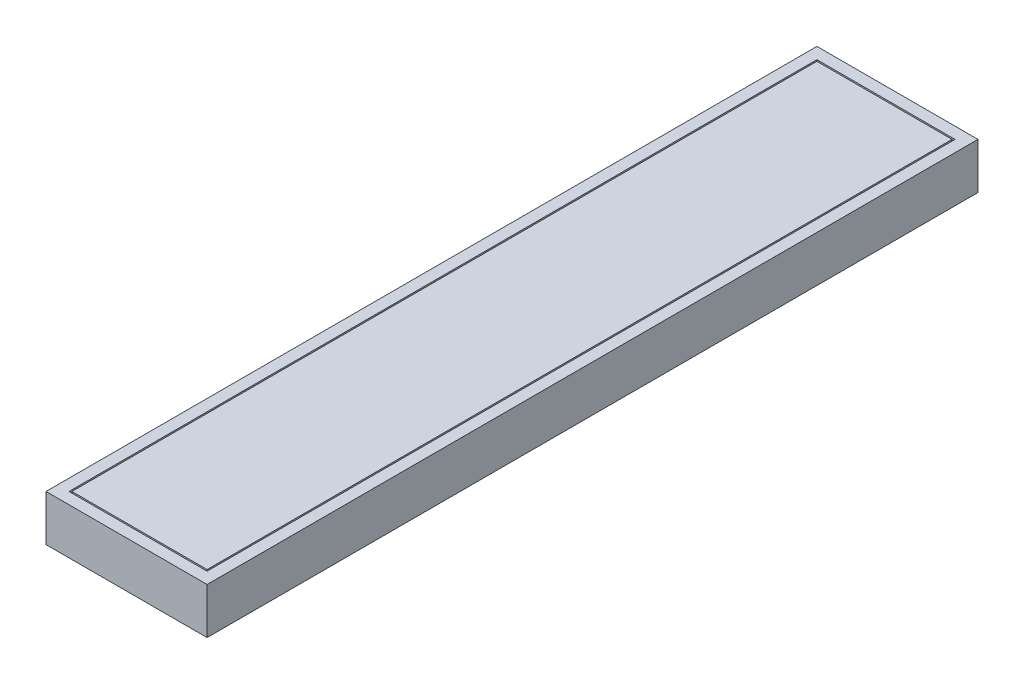
ISO-10303-21;
HEADER;
FILE_DESCRIPTION(('STEP AP214'),'2;1');
FILE_NAME('part.step','',(''),(''),'','','');
FILE_SCHEMA(('AUTOMOTIVE_DESIGN { 1 0 10303 214 1 1 1 1 }'));
ENDSEC;
DATA;
#1=APPLICATION_CONTEXT('core data for automotive mechanical design processes');
#2=APPLICATION_PROTOCOL_DEFINITION('international standard','automotive_design',2000,#1);
#3=PRODUCT_CONTEXT('',#1,'mechanical');
#4=PRODUCT('Part','Part','',(#3));
#5=PRODUCT_RELATED_PRODUCT_CATEGORY('part','',(#4));
#6=PRODUCT_DEFINITION_FORMATION('','',#4);
#7=PRODUCT_DEFINITION_CONTEXT('part definition',#1,'design');
#8=PRODUCT_DEFINITION('design','',#6,#7);
#9=PRODUCT_DEFINITION_SHAPE('','',#8);
#10=(LENGTH_UNIT() NAMED_UNIT(*) SI_UNIT(.MILLI.,.METRE.));
#11=(NAMED_UNIT(*) PLANE_ANGLE_UNIT() SI_UNIT($,.RADIAN.));
#12=(NAMED_UNIT(*) SI_UNIT($,.STERADIAN.) SOLID_ANGLE_UNIT());
#13=UNCERTAINTY_MEASURE_WITH_UNIT(LENGTH_MEASURE(1.E-05),#10,'distance_accuracy_value','');
#14=(GEOMETRIC_REPRESENTATION_CONTEXT(3) GLOBAL_UNCERTAINTY_ASSIGNED_CONTEXT((#13)) GLOBAL_UNIT_ASSIGNED_CONTEXT((#10,
#11,#12)) REPRESENTATION_CONTEXT('',''));
#15=CARTESIAN_POINT('',(0.,0.,0.));
#16=DIRECTION('',(0.,0.,1.));
#17=DIRECTION('',(1.,0.,0.));
#18=AXIS2_PLACEMENT_3D('',#15,#16,#17);
#19=CARTESIAN_POINT('',(0.,8.99999999999999,0.));
#20=DIRECTION('',(0.,1.,0.));
#21=DIRECTION('',(0.,0.,1.));
#22=AXIS2_PLACEMENT_3D('',#19,#20,#21);
#23=PLANE('',#22);
#24=DIRECTION('',(0.,0.,1.));
#25=VECTOR('',#24,1.);
#26=CARTESIAN_POINT('',(-120.,8.99999999999999,20.));
#27=LINE('',#26,#25);
#28=CARTESIAN_POINT('',(-120.,8.99999999999999,20.));
#29=VERTEX_POINT('',#28);
#30=CARTESIAN_POINT('',(-120.,8.99999999999999,1320.));
#31=VERTEX_POINT('',#30);
#32=EDGE_CURVE('E153',#29,#31,#27,.T.);
#33=ORIENTED_EDGE('',*,*,#32,.T.);
#34=DIRECTION('',(1.,0.,0.));
#35=VECTOR('',#34,1.);
#36=CARTESIAN_POINT('',(-120.,8.99999999999999,1320.));
#37=LINE('',#36,#35);
#38=CARTESIAN_POINT('',(120.,8.99999999999999,1320.));
#39=VERTEX_POINT('',#38);
#40=EDGE_CURVE('E156',#31,#39,#37,.T.);
#41=ORIENTED_EDGE('',*,*,#40,.T.);
#42=DIRECTION('',(0.,0.,-1.));
#43=VECTOR('',#42,1.);
#44=CARTESIAN_POINT('',(120.,8.99999999999999,1320.));
#45=LINE('',#44,#43);
#46=CARTESIAN_POINT('',(120.,8.99999999999999,20.));
#47=VERTEX_POINT('',#46);
#48=EDGE_CURVE('E160',#39,#47,#45,.T.);
#49=ORIENTED_EDGE('',*,*,#48,.T.);
#50=DIRECTION('',(-1.,0.,0.));
#51=VECTOR('',#50,1.);
#52=CARTESIAN_POINT('',(120.,8.99999999999999,20.));
#53=LINE('',#52,#51);
#54=EDGE_CURVE('E163',#47,#29,#53,.T.);
#55=ORIENTED_EDGE('',*,*,#54,.T.);
#56=EDGE_LOOP('',(#33,#41,#49,#55));
#57=FACE_BOUND('',#56,.T.);
#58=DIRECTION('',(0.,0.,-1.));
#59=VECTOR('',#58,1.);
#60=CARTESIAN_POINT('',(117.5,8.99999999999999,22.5));
#61=LINE('',#60,#59);
#62=CARTESIAN_POINT('',(117.5,8.99999999999999,1317.5));
#63=VERTEX_POINT('',#62);
#64=CARTESIAN_POINT('',(117.5,8.99999999999999,22.5));
#65=VERTEX_POINT('',#64);
#66=EDGE_CURVE('E370',#63,#65,#61,.T.);
#67=ORIENTED_EDGE('',*,*,#66,.F.);
#68=DIRECTION('',(1.,0.,0.));
#69=VECTOR('',#68,1.);
#70=CARTESIAN_POINT('',(117.5,8.99999999999999,1317.5));
#71=LINE('',#70,#69);
#72=CARTESIAN_POINT('',(-117.5,8.99999999999999,1317.5));
#73=VERTEX_POINT('',#72);
#74=EDGE_CURVE('E145',#73,#63,#71,.T.);
#75=ORIENTED_EDGE('',*,*,#74,.F.);
#76=DIRECTION('',(0.,0.,1.));
#77=VECTOR('',#76,1.);
#78=CARTESIAN_POINT('',(-117.5,8.99999999999999,1317.5));
#79=LINE('',#78,#77);
#80=CARTESIAN_POINT('',(-117.5,8.99999999999999,22.5));
#81=VERTEX_POINT('',#80);
#82=EDGE_CURVE('E141',#81,#73,#79,.T.);
#83=ORIENTED_EDGE('',*,*,#82,.F.);
#84=DIRECTION('',(-1.,0.,0.));
#85=VECTOR('',#84,1.);
#86=CARTESIAN_POINT('',(-117.5,8.99999999999999,22.5));
#87=LINE('',#86,#85);
#88=EDGE_CURVE('E367',#65,#81,#87,.T.);
#89=ORIENTED_EDGE('',*,*,#88,.F.);
#90=EDGE_LOOP('',(#67,#75,#83,#89));
#91=FACE_BOUND('',#90,.T.);
#92=ADVANCED_FACE('F32',(#57,#91),#23,.T.);
#93=CARTESIAN_POINT('',(-140.,20.,1340.));
#94=DIRECTION('',(-1.,0.,0.));
#95=DIRECTION('',(0.,0.,1.));
#96=AXIS2_PLACEMENT_3D('',#93,#94,#95);
#97=PLANE('',#96);
#98=DIRECTION('',(0.,0.,-1.));
#99=VECTOR('',#98,1.);
#100=CARTESIAN_POINT('',(-140.,-60.,1340.));
#101=LINE('',#100,#99);
#102=CARTESIAN_POINT('',(-140.,-60.,1340.));
#103=VERTEX_POINT('',#102);
#104=CARTESIAN_POINT('',(-140.,-60.,0.));
#105=VERTEX_POINT('',#104);
#106=EDGE_CURVE('E176',#103,#105,#101,.T.);
#107=ORIENTED_EDGE('',*,*,#106,.F.);
#108=DIRECTION('',(0.,-1.,0.));
#109=VECTOR('',#108,1.);
#110=CARTESIAN_POINT('',(-140.,20.,1340.));
#111=LINE('',#110,#109);
#112=CARTESIAN_POINT('',(-140.,20.,1340.));
#113=VERTEX_POINT('',#112);
#114=EDGE_CURVE('E11',#113,#103,#111,.T.);
#115=ORIENTED_EDGE('',*,*,#114,.F.);
#116=DIRECTION('',(0.,0.,-1.));
#117=VECTOR('',#116,1.);
#118=CARTESIAN_POINT('',(-140.,20.,1340.));
#119=LINE('',#118,#117);
#120=CARTESIAN_POINT('',(-140.,20.,0.));
#121=VERTEX_POINT('',#120);
#122=EDGE_CURVE('E182',#113,#121,#119,.T.);
#123=ORIENTED_EDGE('',*,*,#122,.T.);
#124=DIRECTION('',(0.,-1.,0.));
#125=VECTOR('',#124,1.);
#126=CARTESIAN_POINT('',(-140.,20.,0.));
#127=LINE('',#126,#125);
#128=EDGE_CURVE('E36',#121,#105,#127,.T.);
#129=ORIENTED_EDGE('',*,*,#128,.T.);
#130=EDGE_LOOP('',(#107,#115,#123,#129));
#131=FACE_BOUND('',#130,.T.);
#132=ADVANCED_FACE('F34',(#131),#97,.T.);
#133=CARTESIAN_POINT('',(140.,20.,1340.));
#134=DIRECTION('',(0.,0.,1.));
#135=DIRECTION('',(1.,0.,0.));
#136=AXIS2_PLACEMENT_3D('',#133,#134,#135);
#137=PLANE('',#136);
#138=DIRECTION('',(-1.,0.,0.));
#139=VECTOR('',#138,1.);
#140=CARTESIAN_POINT('',(140.,-60.,1340.));
#141=LINE('',#140,#139);
#142=CARTESIAN_POINT('',(140.,-60.,1340.));
#143=VERTEX_POINT('',#142);
#144=EDGE_CURVE('E186',#143,#103,#141,.T.);
#145=ORIENTED_EDGE('',*,*,#144,.F.);
#146=DIRECTION('',(0.,-1.,0.));
#147=VECTOR('',#146,1.);
#148=CARTESIAN_POINT('',(140.,20.,1340.));
#149=LINE('',#148,#147);
#150=CARTESIAN_POINT('',(140.,20.,1340.));
#151=VERTEX_POINT('',#150);
#152=EDGE_CURVE('E41',#151,#143,#149,.T.);
#153=ORIENTED_EDGE('',*,*,#152,.F.);
#154=DIRECTION('',(-1.,0.,0.));
#155=VECTOR('',#154,1.);
#156=CARTESIAN_POINT('',(140.,20.,1340.));
#157=LINE('',#156,#155);
#158=EDGE_CURVE('E192',#151,#113,#157,.T.);
#159=ORIENTED_EDGE('',*,*,#158,.T.);
#160=ORIENTED_EDGE('',*,*,#114,.T.);
#161=EDGE_LOOP('',(#145,#153,#159,#160));
#162=FACE_BOUND('',#161,.T.);
#163=ADVANCED_FACE('F218',(#162),#137,.T.);
#164=CARTESIAN_POINT('',(140.,20.,0.));
#165=DIRECTION('',(1.,0.,0.));
#166=DIRECTION('',(0.,0.,-1.));
#167=AXIS2_PLACEMENT_3D('',#164,#165,#166);
#168=PLANE('',#167);
#169=DIRECTION('',(0.,0.,1.));
#170=VECTOR('',#169,1.);
#171=CARTESIAN_POINT('',(140.,-60.,0.));
#172=LINE('',#171,#170);
#173=CARTESIAN_POINT('',(140.,-60.,0.));
#174=VERTEX_POINT('',#173);
#175=EDGE_CURVE('E200',#174,#143,#172,.T.);
#176=ORIENTED_EDGE('',*,*,#175,.F.);
#177=DIRECTION('',(0.,-1.,0.));
#178=VECTOR('',#177,1.);
#179=CARTESIAN_POINT('',(140.,20.,0.));
#180=LINE('',#179,#178);
#181=CARTESIAN_POINT('',(140.,20.,0.));
#182=VERTEX_POINT('',#181);
#183=EDGE_CURVE('E205',#182,#174,#180,.T.);
#184=ORIENTED_EDGE('',*,*,#183,.F.);
#185=DIRECTION('',(0.,0.,1.));
#186=VECTOR('',#185,1.);
#187=CARTESIAN_POINT('',(140.,20.,0.));
#188=LINE('',#187,#186);
#189=EDGE_CURVE('E189',#182,#151,#188,.T.);
#190=ORIENTED_EDGE('',*,*,#189,.T.);
#191=ORIENTED_EDGE('',*,*,#152,.T.);
#192=EDGE_LOOP('',(#176,#184,#190,#191));
#193=FACE_BOUND('',#192,.T.);
#194=ADVANCED_FACE('F224',(#193),#168,.T.);
#195=CARTESIAN_POINT('',(-140.,20.,0.));
#196=DIRECTION('',(0.,0.,-1.));
#197=DIRECTION('',(-1.,0.,0.));
#198=AXIS2_PLACEMENT_3D('',#195,#196,#197);
#199=PLANE('',#198);
#200=DIRECTION('',(1.,0.,0.));
#201=VECTOR('',#200,1.);
#202=CARTESIAN_POINT('',(-140.,-60.,0.));
#203=LINE('',#202,#201);
#204=EDGE_CURVE('E197',#105,#174,#203,.T.);
#205=ORIENTED_EDGE('',*,*,#204,.F.);
#206=ORIENTED_EDGE('',*,*,#128,.F.);
#207=DIRECTION('',(1.,0.,0.));
#208=VECTOR('',#207,1.);
#209=CARTESIAN_POINT('',(-140.,20.,0.));
#210=LINE('',#209,#208);
#211=EDGE_CURVE('E185',#121,#182,#210,.T.);
#212=ORIENTED_EDGE('',*,*,#211,.T.);
#213=ORIENTED_EDGE('',*,*,#183,.T.);
#214=EDGE_LOOP('',(#205,#206,#212,#213));
#215=FACE_BOUND('',#214,.T.);
#216=ADVANCED_FACE('F213',(#215),#199,.T.);
#217=CARTESIAN_POINT('',(0.,20.,0.));
#218=DIRECTION('',(0.,-1.,0.));
#219=DIRECTION('',(0.,0.,-1.));
#220=AXIS2_PLACEMENT_3D('',#217,#218,#219);
#221=PLANE('',#220);
#222=DIRECTION('',(1.,0.,0.));
#223=VECTOR('',#222,1.);
#224=CARTESIAN_POINT('',(-120.,20.,1320.));
#225=LINE('',#224,#223);
#226=CARTESIAN_POINT('',(-120.,20.,1320.));
#227=VERTEX_POINT('',#226);
#228=CARTESIAN_POINT('',(120.,20.,1320.));
#229=VERTEX_POINT('',#228);
#230=EDGE_CURVE('E148',#227,#229,#225,.T.);
#231=ORIENTED_EDGE('',*,*,#230,.F.);
#232=DIRECTION('',(0.,0.,1.));
#233=VECTOR('',#232,1.);
#234=CARTESIAN_POINT('',(-120.,20.,20.));
#235=LINE('',#234,#233);
#236=CARTESIAN_POINT('',(-120.,20.,20.));
#237=VERTEX_POINT('',#236);
#238=EDGE_CURVE('E57',#237,#227,#235,.T.);
#239=ORIENTED_EDGE('',*,*,#238,.F.);
#240=DIRECTION('',(-1.,0.,0.));
#241=VECTOR('',#240,1.);
#242=CARTESIAN_POINT('',(120.,20.,20.));
#243=LINE('',#242,#241);
#244=CARTESIAN_POINT('',(120.,20.,20.));
#245=VERTEX_POINT('',#244);
#246=EDGE_CURVE('E157',#245,#237,#243,.T.);
#247=ORIENTED_EDGE('',*,*,#246,.F.);
#248=DIRECTION('',(0.,0.,-1.));
#249=VECTOR('',#248,1.);
#250=CARTESIAN_POINT('',(120.,20.,1320.));
#251=LINE('',#250,#249);
#252=EDGE_CURVE('E169',#229,#245,#251,.T.);
#253=ORIENTED_EDGE('',*,*,#252,.F.);
#254=EDGE_LOOP('',(#231,#239,#247,#253));
#255=FACE_BOUND('',#254,.T.);
#256=ORIENTED_EDGE('',*,*,#122,.F.);
#257=ORIENTED_EDGE('',*,*,#158,.F.);
#258=ORIENTED_EDGE('',*,*,#189,.F.);
#259=ORIENTED_EDGE('',*,*,#211,.F.);
#260=EDGE_LOOP('',(#256,#257,#258,#259));
#261=FACE_BOUND('',#260,.T.);
#262=ADVANCED_FACE('F221',(#255,#261),#221,.F.);
#263=CARTESIAN_POINT('',(0.,-60.,0.));
#264=DIRECTION('',(0.,-1.,0.));
#265=DIRECTION('',(0.,0.,-1.));
#266=AXIS2_PLACEMENT_3D('',#263,#264,#265);
#267=PLANE('',#266);
#268=ORIENTED_EDGE('',*,*,#106,.T.);
#269=ORIENTED_EDGE('',*,*,#204,.T.);
#270=ORIENTED_EDGE('',*,*,#175,.T.);
#271=ORIENTED_EDGE('',*,*,#144,.T.);
#272=EDGE_LOOP('',(#268,#269,#270,#271));
#273=FACE_BOUND('',#272,.T.);
#274=ADVANCED_FACE('F215',(#273),#267,.T.);
#275=CARTESIAN_POINT('',(-120.,8.99999999999999,20.));
#276=DIRECTION('',(-1.,0.,0.));
#277=DIRECTION('',(0.,0.,1.));
#278=AXIS2_PLACEMENT_3D('',#275,#276,#277);
#279=PLANE('',#278);
#280=ORIENTED_EDGE('',*,*,#238,.T.);
#281=DIRECTION('',(0.,1.,0.));
#282=VECTOR('',#281,1.);
#283=CARTESIAN_POINT('',(-120.,8.99999999999999,1320.));
#284=LINE('',#283,#282);
#285=EDGE_CURVE('E165',#31,#227,#284,.T.);
#286=ORIENTED_EDGE('',*,*,#285,.F.);
#287=ORIENTED_EDGE('',*,*,#32,.F.);
#288=DIRECTION('',(0.,1.,0.));
#289=VECTOR('',#288,1.);
#290=CARTESIAN_POINT('',(-120.,8.99999999999999,20.));
#291=LINE('',#290,#289);
#292=EDGE_CURVE('E174',#29,#237,#291,.T.);
#293=ORIENTED_EDGE('',*,*,#292,.T.);
#294=EDGE_LOOP('',(#280,#286,#287,#293));
#295=FACE_BOUND('',#294,.T.);
#296=ADVANCED_FACE('F246',(#295),#279,.F.);
#297=CARTESIAN_POINT('',(120.,8.99999999999999,20.));
#298=DIRECTION('',(0.,0.,-1.));
#299=DIRECTION('',(-1.,0.,0.));
#300=AXIS2_PLACEMENT_3D('',#297,#298,#299);
#301=PLANE('',#300);
#302=ORIENTED_EDGE('',*,*,#246,.T.);
#303=ORIENTED_EDGE('',*,*,#292,.F.);
#304=ORIENTED_EDGE('',*,*,#54,.F.);
#305=DIRECTION('',(0.,1.,0.));
#306=VECTOR('',#305,1.);
#307=CARTESIAN_POINT('',(120.,8.99999999999999,20.));
#308=LINE('',#307,#306);
#309=EDGE_CURVE('E177',#47,#245,#308,.T.);
#310=ORIENTED_EDGE('',*,*,#309,.T.);
#311=EDGE_LOOP('',(#302,#303,#304,#310));
#312=FACE_BOUND('',#311,.T.);
#313=ADVANCED_FACE('F242',(#312),#301,.F.);
#314=CARTESIAN_POINT('',(120.,8.99999999999999,1320.));
#315=DIRECTION('',(1.,0.,0.));
#316=DIRECTION('',(0.,0.,-1.));
#317=AXIS2_PLACEMENT_3D('',#314,#315,#316);
#318=PLANE('',#317);
#319=ORIENTED_EDGE('',*,*,#252,.T.);
#320=ORIENTED_EDGE('',*,*,#309,.F.);
#321=ORIENTED_EDGE('',*,*,#48,.F.);
#322=DIRECTION('',(0.,1.,0.));
#323=VECTOR('',#322,1.);
#324=CARTESIAN_POINT('',(120.,8.99999999999999,1320.));
#325=LINE('',#324,#323);
#326=EDGE_CURVE('E179',#39,#229,#325,.T.);
#327=ORIENTED_EDGE('',*,*,#326,.T.);
#328=EDGE_LOOP('',(#319,#320,#321,#327));
#329=FACE_BOUND('',#328,.T.);
#330=ADVANCED_FACE('F245',(#329),#318,.F.);
#331=CARTESIAN_POINT('',(-120.,8.99999999999999,1320.));
#332=DIRECTION('',(0.,0.,1.));
#333=DIRECTION('',(1.,0.,0.));
#334=AXIS2_PLACEMENT_3D('',#331,#332,#333);
#335=PLANE('',#334);
#336=ORIENTED_EDGE('',*,*,#230,.T.);
#337=ORIENTED_EDGE('',*,*,#326,.F.);
#338=ORIENTED_EDGE('',*,*,#40,.F.);
#339=ORIENTED_EDGE('',*,*,#285,.T.);
#340=EDGE_LOOP('',(#336,#337,#338,#339));
#341=FACE_BOUND('',#340,.T.);
#342=ADVANCED_FACE('F250',(#341),#335,.F.);
#343=CARTESIAN_POINT('',(117.5,20.,1317.5));
#344=DIRECTION('',(0.,0.,-1.));
#345=DIRECTION('',(-1.,0.,0.));
#346=AXIS2_PLACEMENT_3D('',#343,#344,#345);
#347=PLANE('',#346);
#348=ORIENTED_EDGE('',*,*,#74,.T.);
#349=DIRECTION('',(0.,-1.,0.));
#350=VECTOR('',#349,1.);
#351=CARTESIAN_POINT('',(117.5,20.,1317.5));
#352=LINE('',#351,#350);
#353=CARTESIAN_POINT('',(117.5,20.,1317.5));
#354=VERTEX_POINT('',#353);
#355=EDGE_CURVE('E126',#354,#63,#352,.T.);
#356=ORIENTED_EDGE('',*,*,#355,.F.);
#357=DIRECTION('',(1.,0.,0.));
#358=VECTOR('',#357,1.);
#359=CARTESIAN_POINT('',(117.5,20.,1317.5));
#360=LINE('',#359,#358);
#361=CARTESIAN_POINT('',(-117.5,20.,1317.5));
#362=VERTEX_POINT('',#361);
#363=EDGE_CURVE('E133',#362,#354,#360,.T.);
#364=ORIENTED_EDGE('',*,*,#363,.F.);
#365=DIRECTION('',(0.,-1.,0.));
#366=VECTOR('',#365,1.);
#367=CARTESIAN_POINT('',(-117.5,20.,1317.5));
#368=LINE('',#367,#366);
#369=EDGE_CURVE('E365',#362,#73,#368,.T.);
#370=ORIENTED_EDGE('',*,*,#369,.T.);
#371=EDGE_LOOP('',(#348,#356,#364,#370));
#372=FACE_BOUND('',#371,.T.);
#373=ADVANCED_FACE('F143',(#372),#347,.F.);
#374=CARTESIAN_POINT('',(117.5,20.,22.5));
#375=DIRECTION('',(-1.,0.,0.));
#376=DIRECTION('',(0.,0.,1.));
#377=AXIS2_PLACEMENT_3D('',#374,#375,#376);
#378=PLANE('',#377);
#379=ORIENTED_EDGE('',*,*,#66,.T.);
#380=DIRECTION('',(0.,-1.,0.));
#381=VECTOR('',#380,1.);
#382=CARTESIAN_POINT('',(117.5,20.,22.5));
#383=LINE('',#382,#381);
#384=CARTESIAN_POINT('',(117.5,20.,22.5));
#385=VERTEX_POINT('',#384);
#386=EDGE_CURVE('E129',#385,#65,#383,.T.);
#387=ORIENTED_EDGE('',*,*,#386,.F.);
#388=DIRECTION('',(0.,0.,-1.));
#389=VECTOR('',#388,1.);
#390=CARTESIAN_POINT('',(117.5,20.,22.5));
#391=LINE('',#390,#389);
#392=EDGE_CURVE('E122',#354,#385,#391,.T.);
#393=ORIENTED_EDGE('',*,*,#392,.F.);
#394=ORIENTED_EDGE('',*,*,#355,.T.);
#395=EDGE_LOOP('',(#379,#387,#393,#394));
#396=FACE_BOUND('',#395,.T.);
#397=ADVANCED_FACE('F124',(#396),#378,.F.);
#398=CARTESIAN_POINT('',(-117.5,20.,22.5));
#399=DIRECTION('',(0.,0.,1.));
#400=DIRECTION('',(1.,0.,0.));
#401=AXIS2_PLACEMENT_3D('',#398,#399,#400);
#402=PLANE('',#401);
#403=ORIENTED_EDGE('',*,*,#88,.T.);
#404=DIRECTION('',(0.,-1.,0.));
#405=VECTOR('',#404,1.);
#406=CARTESIAN_POINT('',(-117.5,20.,22.5));
#407=LINE('',#406,#405);
#408=CARTESIAN_POINT('',(-117.5,20.,22.5));
#409=VERTEX_POINT('',#408);
#410=EDGE_CURVE('E49',#409,#81,#407,.T.);
#411=ORIENTED_EDGE('',*,*,#410,.F.);
#412=DIRECTION('',(-1.,0.,0.));
#413=VECTOR('',#412,1.);
#414=CARTESIAN_POINT('',(-117.5,20.,22.5));
#415=LINE('',#414,#413);
#416=EDGE_CURVE('E132',#385,#409,#415,.T.);
#417=ORIENTED_EDGE('',*,*,#416,.F.);
#418=ORIENTED_EDGE('',*,*,#386,.T.);
#419=EDGE_LOOP('',(#403,#411,#417,#418));
#420=FACE_BOUND('',#419,.T.);
#421=ADVANCED_FACE('F293',(#420),#402,.F.);
#422=CARTESIAN_POINT('',(-117.5,20.,1317.5));
#423=DIRECTION('',(1.,0.,0.));
#424=DIRECTION('',(0.,0.,-1.));
#425=AXIS2_PLACEMENT_3D('',#422,#423,#424);
#426=PLANE('',#425);
#427=ORIENTED_EDGE('',*,*,#82,.T.);
#428=ORIENTED_EDGE('',*,*,#369,.F.);
#429=DIRECTION('',(0.,0.,1.));
#430=VECTOR('',#429,1.);
#431=CARTESIAN_POINT('',(-117.5,20.,1317.5));
#432=LINE('',#431,#430);
#433=EDGE_CURVE('E137',#409,#362,#432,.T.);
#434=ORIENTED_EDGE('',*,*,#433,.F.);
#435=ORIENTED_EDGE('',*,*,#410,.T.);
#436=EDGE_LOOP('',(#427,#428,#434,#435));
#437=FACE_BOUND('',#436,.T.);
#438=ADVANCED_FACE('F299',(#437),#426,.F.);
#439=CARTESIAN_POINT('',(0.,20.,0.));
#440=DIRECTION('',(0.,-1.,0.));
#441=DIRECTION('',(0.,0.,-1.));
#442=AXIS2_PLACEMENT_3D('',#439,#440,#441);
#443=PLANE('',#442);
#444=ORIENTED_EDGE('',*,*,#363,.T.);
#445=ORIENTED_EDGE('',*,*,#392,.T.);
#446=ORIENTED_EDGE('',*,*,#416,.T.);
#447=ORIENTED_EDGE('',*,*,#433,.T.);
#448=EDGE_LOOP('',(#444,#445,#446,#447));
#449=FACE_BOUND('',#448,.T.);
#450=ADVANCED_FACE('F136',(#449),#443,.F.);
#451=CLOSED_SHELL('',(#92,#132,#163,#194,#216,#262,#274,#296,#313,#330,#342,#373,#397,#421,#438,#450));
#452=MANIFOLD_SOLID_BREP('B2',#451);
#453=ADVANCED_BREP_SHAPE_REPRESENTATION('',(#18,#452),#14);
#454=SHAPE_DEFINITION_REPRESENTATION(#9,#453);
ENDSEC;
END-ISO-10303-21;
